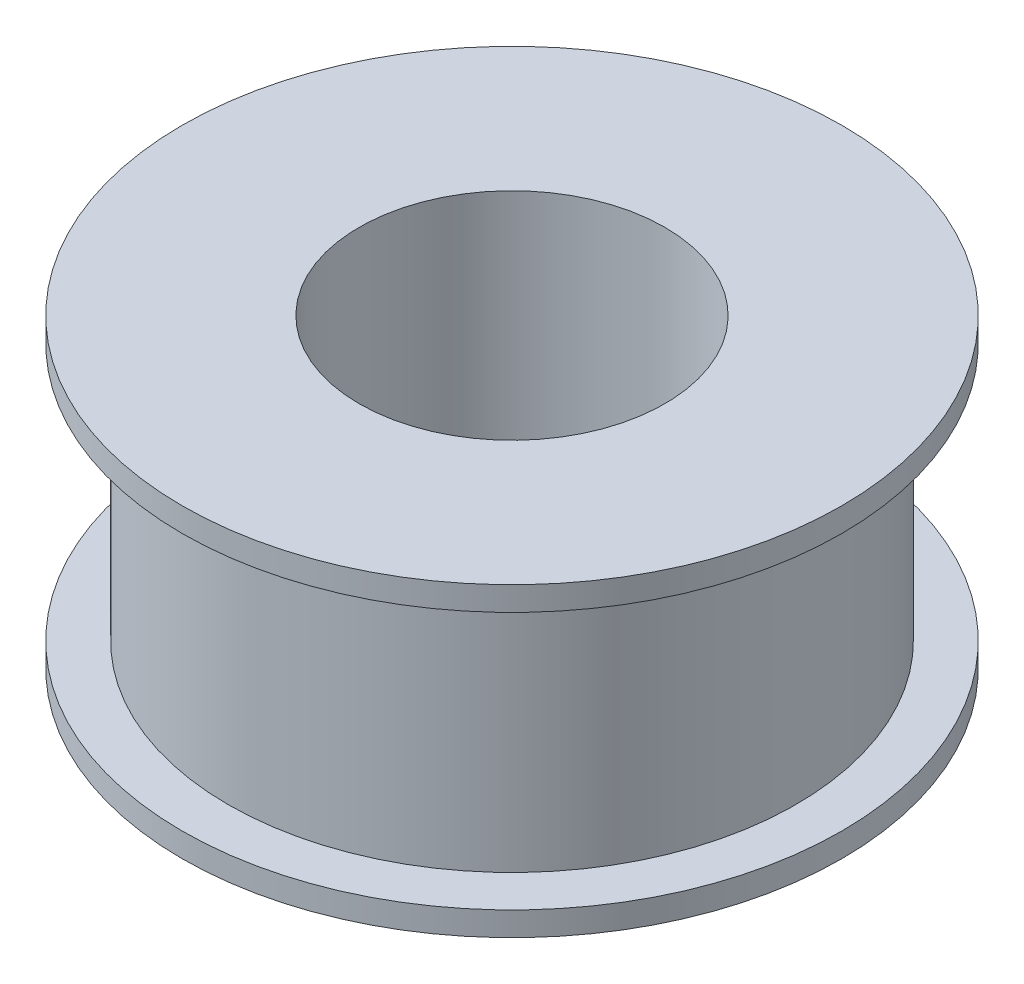
ISO-10303-21;
HEADER;
FILE_DESCRIPTION(('STEP AP214'),'2;1');
FILE_NAME('part.step','',(''),(''),'','','');
FILE_SCHEMA(('AUTOMOTIVE_DESIGN { 1 0 10303 214 1 1 1 1 }'));
ENDSEC;
DATA;
#1=APPLICATION_CONTEXT('core data for automotive mechanical design processes');
#2=APPLICATION_PROTOCOL_DEFINITION('international standard','automotive_design',2000,#1);
#3=PRODUCT_CONTEXT('',#1,'mechanical');
#4=PRODUCT('Part','Part','',(#3));
#5=PRODUCT_RELATED_PRODUCT_CATEGORY('part','',(#4));
#6=PRODUCT_DEFINITION_FORMATION('','',#4);
#7=PRODUCT_DEFINITION_CONTEXT('part definition',#1,'design');
#8=PRODUCT_DEFINITION('design','',#6,#7);
#9=PRODUCT_DEFINITION_SHAPE('','',#8);
#10=(LENGTH_UNIT() NAMED_UNIT(*) SI_UNIT(.MILLI.,.METRE.));
#11=(NAMED_UNIT(*) PLANE_ANGLE_UNIT() SI_UNIT($,.RADIAN.));
#12=(NAMED_UNIT(*) SI_UNIT($,.STERADIAN.) SOLID_ANGLE_UNIT());
#13=UNCERTAINTY_MEASURE_WITH_UNIT(LENGTH_MEASURE(1.E-05),#10,'distance_accuracy_value','');
#14=(GEOMETRIC_REPRESENTATION_CONTEXT(3) GLOBAL_UNCERTAINTY_ASSIGNED_CONTEXT((#13)) GLOBAL_UNIT_ASSIGNED_CONTEXT((#10,
#11,#12)) REPRESENTATION_CONTEXT('',''));
#15=CARTESIAN_POINT('',(0.,0.,0.));
#16=DIRECTION('',(0.,0.,1.));
#17=DIRECTION('',(1.,0.,0.));
#18=AXIS2_PLACEMENT_3D('',#15,#16,#17);
#19=CARTESIAN_POINT('',(0.,7.,7.));
#20=DIRECTION('',(0.,1.,0.));
#21=DIRECTION('',(0.,0.,1.));
#22=AXIS2_PLACEMENT_3D('',#19,#20,#21);
#23=PLANE('',#22);
#24=CARTESIAN_POINT('',(0.,7.,0.));
#25=DIRECTION('',(0.,1.,0.));
#26=DIRECTION('',(0.,0.,1.));
#27=AXIS2_PLACEMENT_3D('',#24,#25,#26);
#28=CIRCLE('',#27,15.1);
#29=CARTESIAN_POINT('',(0.,7.,15.1));
#30=VERTEX_POINT('',#29);
#31=EDGE_CURVE('E10',#30,#30,#28,.T.);
#32=ORIENTED_EDGE('',*,*,#31,.T.);
#33=EDGE_LOOP('',(#32));
#34=FACE_BOUND('',#33,.T.);
#35=CARTESIAN_POINT('',(0.,7.,0.));
#36=DIRECTION('',(0.,1.,0.));
#37=DIRECTION('',(0.,0.,1.));
#38=AXIS2_PLACEMENT_3D('',#35,#36,#37);
#39=CIRCLE('',#38,7.);
#40=CARTESIAN_POINT('',(0.,7.,7.));
#41=VERTEX_POINT('',#40);
#42=EDGE_CURVE('E72',#41,#41,#39,.T.);
#43=ORIENTED_EDGE('',*,*,#42,.F.);
#44=EDGE_LOOP('',(#43));
#45=FACE_BOUND('',#44,.T.);
#46=ADVANCED_FACE('F37',(#34,#45),#23,.T.);
#47=CARTESIAN_POINT('',(0.,7.7,0.));
#48=DIRECTION('',(0.,1.,0.));
#49=DIRECTION('',(0.,0.,1.));
#50=AXIS2_PLACEMENT_3D('',#47,#48,#49);
#51=CYLINDRICAL_SURFACE('',#50,15.1);
#52=CARTESIAN_POINT('',(0.,5.9,0.));
#53=DIRECTION('',(0.,1.,0.));
#54=DIRECTION('',(0.,0.,1.));
#55=AXIS2_PLACEMENT_3D('',#52,#53,#54);
#56=CIRCLE('',#55,15.1);
#57=CARTESIAN_POINT('',(0.,5.9,15.1));
#58=VERTEX_POINT('',#57);
#59=EDGE_CURVE('E44',#58,#58,#56,.T.);
#60=ORIENTED_EDGE('',*,*,#59,.T.);
#61=EDGE_LOOP('',(#60));
#62=FACE_BOUND('',#61,.T.);
#63=ORIENTED_EDGE('',*,*,#31,.F.);
#64=EDGE_LOOP('',(#63));
#65=FACE_BOUND('',#64,.T.);
#66=ADVANCED_FACE('F81',(#62,#65),#51,.T.);
#67=CARTESIAN_POINT('',(0.,5.9,15.1));
#68=DIRECTION('',(0.,-1.,0.));
#69=DIRECTION('',(0.,0.,-1.));
#70=AXIS2_PLACEMENT_3D('',#67,#68,#69);
#71=PLANE('',#70);
#72=CARTESIAN_POINT('',(0.,5.9,0.));
#73=DIRECTION('',(0.,1.,0.));
#74=DIRECTION('',(0.,0.,1.));
#75=AXIS2_PLACEMENT_3D('',#72,#73,#74);
#76=CIRCLE('',#75,13.);
#77=CARTESIAN_POINT('',(0.,5.9,13.));
#78=VERTEX_POINT('',#77);
#79=EDGE_CURVE('E49',#78,#78,#76,.T.);
#80=ORIENTED_EDGE('',*,*,#79,.T.);
#81=EDGE_LOOP('',(#80));
#82=FACE_BOUND('',#81,.T.);
#83=ORIENTED_EDGE('',*,*,#59,.F.);
#84=EDGE_LOOP('',(#83));
#85=FACE_BOUND('',#84,.T.);
#86=ADVANCED_FACE('F85',(#82,#85),#71,.T.);
#87=CARTESIAN_POINT('',(0.,7.7,0.));
#88=DIRECTION('',(0.,1.,0.));
#89=DIRECTION('',(0.,0.,1.));
#90=AXIS2_PLACEMENT_3D('',#87,#88,#89);
#91=CYLINDRICAL_SURFACE('',#90,13.);
#92=CARTESIAN_POINT('',(0.,-5.9,0.));
#93=DIRECTION('',(0.,1.,0.));
#94=DIRECTION('',(0.,0.,1.));
#95=AXIS2_PLACEMENT_3D('',#92,#93,#94);
#96=CIRCLE('',#95,13.);
#97=CARTESIAN_POINT('',(0.,-5.9,13.));
#98=VERTEX_POINT('',#97);
#99=EDGE_CURVE('E54',#98,#98,#96,.T.);
#100=ORIENTED_EDGE('',*,*,#99,.T.);
#101=EDGE_LOOP('',(#100));
#102=FACE_BOUND('',#101,.T.);
#103=ORIENTED_EDGE('',*,*,#79,.F.);
#104=EDGE_LOOP('',(#103));
#105=FACE_BOUND('',#104,.T.);
#106=ADVANCED_FACE('F89',(#102,#105),#91,.T.);
#107=CARTESIAN_POINT('',(0.,-5.9,15.1));
#108=DIRECTION('',(0.,1.,0.));
#109=DIRECTION('',(0.,0.,1.));
#110=AXIS2_PLACEMENT_3D('',#107,#108,#109);
#111=PLANE('',#110);
#112=CARTESIAN_POINT('',(0.,-5.9,0.));
#113=DIRECTION('',(0.,1.,0.));
#114=DIRECTION('',(0.,0.,1.));
#115=AXIS2_PLACEMENT_3D('',#112,#113,#114);
#116=CIRCLE('',#115,15.1);
#117=CARTESIAN_POINT('',(0.,-5.9,15.1));
#118=VERTEX_POINT('',#117);
#119=EDGE_CURVE('E60',#118,#118,#116,.T.);
#120=ORIENTED_EDGE('',*,*,#119,.T.);
#121=EDGE_LOOP('',(#120));
#122=FACE_BOUND('',#121,.T.);
#123=ORIENTED_EDGE('',*,*,#99,.F.);
#124=EDGE_LOOP('',(#123));
#125=FACE_BOUND('',#124,.T.);
#126=ADVANCED_FACE('F96',(#122,#125),#111,.T.);
#127=CARTESIAN_POINT('',(0.,7.7,0.));
#128=DIRECTION('',(0.,1.,0.));
#129=DIRECTION('',(0.,0.,1.));
#130=AXIS2_PLACEMENT_3D('',#127,#128,#129);
#131=CYLINDRICAL_SURFACE('',#130,15.1);
#132=CARTESIAN_POINT('',(0.,-7.,0.));
#133=DIRECTION('',(0.,1.,0.));
#134=DIRECTION('',(0.,0.,1.));
#135=AXIS2_PLACEMENT_3D('',#132,#133,#134);
#136=CIRCLE('',#135,15.1);
#137=CARTESIAN_POINT('',(0.,-7.,15.1));
#138=VERTEX_POINT('',#137);
#139=EDGE_CURVE('E64',#138,#138,#136,.T.);
#140=ORIENTED_EDGE('',*,*,#139,.T.);
#141=EDGE_LOOP('',(#140));
#142=FACE_BOUND('',#141,.T.);
#143=ORIENTED_EDGE('',*,*,#119,.F.);
#144=EDGE_LOOP('',(#143));
#145=FACE_BOUND('',#144,.T.);
#146=ADVANCED_FACE('F100',(#142,#145),#131,.T.);
#147=CARTESIAN_POINT('',(0.,-7.,7.));
#148=DIRECTION('',(0.,-1.,0.));
#149=DIRECTION('',(0.,0.,-1.));
#150=AXIS2_PLACEMENT_3D('',#147,#148,#149);
#151=PLANE('',#150);
#152=CARTESIAN_POINT('',(0.,-7.,0.));
#153=DIRECTION('',(0.,1.,0.));
#154=DIRECTION('',(0.,0.,1.));
#155=AXIS2_PLACEMENT_3D('',#152,#153,#154);
#156=CIRCLE('',#155,7.);
#157=CARTESIAN_POINT('',(0.,-7.,7.));
#158=VERTEX_POINT('',#157);
#159=EDGE_CURVE('E68',#158,#158,#156,.T.);
#160=ORIENTED_EDGE('',*,*,#159,.T.);
#161=EDGE_LOOP('',(#160));
#162=FACE_BOUND('',#161,.T.);
#163=ORIENTED_EDGE('',*,*,#139,.F.);
#164=EDGE_LOOP('',(#163));
#165=FACE_BOUND('',#164,.T.);
#166=ADVANCED_FACE('F104',(#162,#165),#151,.T.);
#167=CARTESIAN_POINT('',(0.,7.7,0.));
#168=DIRECTION('',(0.,1.,0.));
#169=DIRECTION('',(0.,0.,1.));
#170=AXIS2_PLACEMENT_3D('',#167,#168,#169);
#171=CYLINDRICAL_SURFACE('',#170,7.);
#172=ORIENTED_EDGE('',*,*,#42,.T.);
#173=EDGE_LOOP('',(#172));
#174=FACE_BOUND('',#173,.T.);
#175=ORIENTED_EDGE('',*,*,#159,.F.);
#176=EDGE_LOOP('',(#175));
#177=FACE_BOUND('',#176,.T.);
#178=ADVANCED_FACE('F77',(#174,#177),#171,.F.);
#179=CLOSED_SHELL('',(#46,#66,#86,#106,#126,#146,#166,#178));
#180=MANIFOLD_SOLID_BREP('B2',#179);
#181=ADVANCED_BREP_SHAPE_REPRESENTATION('',(#18,#180),#14);
#182=SHAPE_DEFINITION_REPRESENTATION(#9,#181);
ENDSEC;
END-ISO-10303-21;
